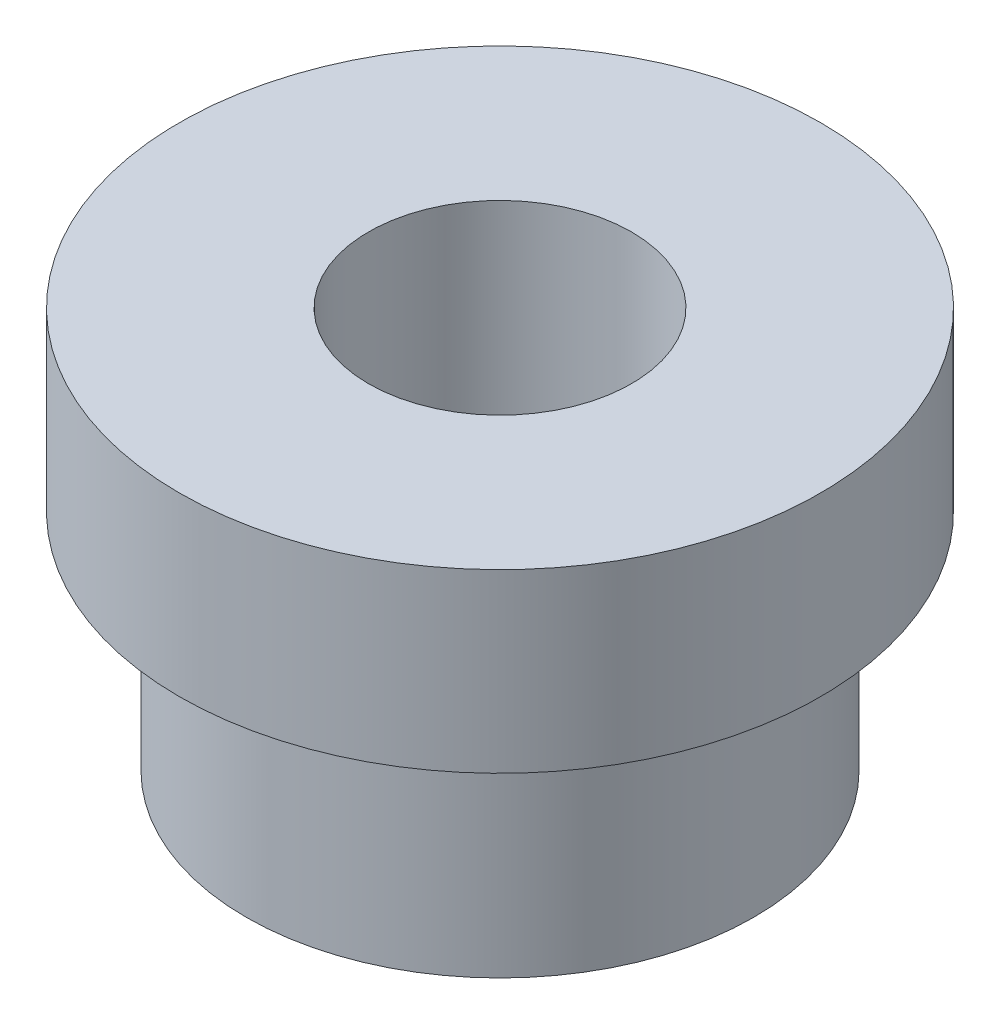
ISO-10303-21;
HEADER;
FILE_DESCRIPTION(('STEP AP214'),'2;1');
FILE_NAME('part.step','',(''),(''),'','','');
FILE_SCHEMA(('AUTOMOTIVE_DESIGN { 1 0 10303 214 1 1 1 1 }'));
ENDSEC;
DATA;
#1=APPLICATION_CONTEXT('core data for automotive mechanical design processes');
#2=APPLICATION_PROTOCOL_DEFINITION('international standard','automotive_design',2000,#1);
#3=PRODUCT_CONTEXT('',#1,'mechanical');
#4=PRODUCT('Part','Part','',(#3));
#5=PRODUCT_RELATED_PRODUCT_CATEGORY('part','',(#4));
#6=PRODUCT_DEFINITION_FORMATION('','',#4);
#7=PRODUCT_DEFINITION_CONTEXT('part definition',#1,'design');
#8=PRODUCT_DEFINITION('design','',#6,#7);
#9=PRODUCT_DEFINITION_SHAPE('','',#8);
#10=(LENGTH_UNIT() NAMED_UNIT(*) SI_UNIT(.MILLI.,.METRE.));
#11=(NAMED_UNIT(*) PLANE_ANGLE_UNIT() SI_UNIT($,.RADIAN.));
#12=(NAMED_UNIT(*) SI_UNIT($,.STERADIAN.) SOLID_ANGLE_UNIT());
#13=UNCERTAINTY_MEASURE_WITH_UNIT(LENGTH_MEASURE(1.E-05),#10,'distance_accuracy_value','');
#14=(GEOMETRIC_REPRESENTATION_CONTEXT(3) GLOBAL_UNCERTAINTY_ASSIGNED_CONTEXT((#13)) GLOBAL_UNIT_ASSIGNED_CONTEXT((#10,
#11,#12)) REPRESENTATION_CONTEXT('',''));
#15=CARTESIAN_POINT('',(0.,0.,0.));
#16=DIRECTION('',(0.,0.,1.));
#17=DIRECTION('',(1.,0.,0.));
#18=AXIS2_PLACEMENT_3D('',#15,#16,#17);
#19=CARTESIAN_POINT('',(0.,19.05,0.));
#20=DIRECTION('',(0.,-1.,0.));
#21=DIRECTION('',(0.,0.,-1.));
#22=AXIS2_PLACEMENT_3D('',#19,#20,#21);
#23=PLANE('',#22);
#24=CARTESIAN_POINT('',(0.,19.05,0.));
#25=DIRECTION('',(0.,1.,0.));
#26=DIRECTION('',(0.,0.,1.));
#27=AXIS2_PLACEMENT_3D('',#24,#25,#26);
#28=CIRCLE('',#27,6.24999999999999);
#29=CARTESIAN_POINT('',(0.,19.05,6.24999999999999));
#30=VERTEX_POINT('',#29);
#31=EDGE_CURVE('E59',#30,#30,#28,.T.);
#32=ORIENTED_EDGE('',*,*,#31,.F.);
#33=EDGE_LOOP('',(#32));
#34=FACE_BOUND('',#33,.T.);
#35=CARTESIAN_POINT('',(0.,19.05,0.));
#36=DIRECTION('',(0.,-1.,0.));
#37=DIRECTION('',(0.,0.,-1.));
#38=AXIS2_PLACEMENT_3D('',#35,#36,#37);
#39=CIRCLE('',#38,15.24);
#40=CARTESIAN_POINT('',(0.,19.05,-15.24));
#41=VERTEX_POINT('',#40);
#42=EDGE_CURVE('E51',#41,#41,#39,.T.);
#43=ORIENTED_EDGE('',*,*,#42,.F.);
#44=EDGE_LOOP('',(#43));
#45=FACE_BOUND('',#44,.T.);
#46=ADVANCED_FACE('F37',(#34,#45),#23,.F.);
#47=CARTESIAN_POINT('',(0.,0.,0.));
#48=DIRECTION('',(0.,-1.,0.));
#49=DIRECTION('',(0.,0.,-1.));
#50=AXIS2_PLACEMENT_3D('',#47,#48,#49);
#51=PLANE('',#50);
#52=CARTESIAN_POINT('',(0.,0.,0.));
#53=DIRECTION('',(0.,1.,0.));
#54=DIRECTION('',(0.,0.,1.));
#55=AXIS2_PLACEMENT_3D('',#52,#53,#54);
#56=CIRCLE('',#55,6.25);
#57=CARTESIAN_POINT('',(0.,0.,6.25));
#58=VERTEX_POINT('',#57);
#59=EDGE_CURVE('E56',#58,#58,#56,.T.);
#60=ORIENTED_EDGE('',*,*,#59,.T.);
#61=EDGE_LOOP('',(#60));
#62=FACE_BOUND('',#61,.T.);
#63=CARTESIAN_POINT('',(0.,0.,0.));
#64=DIRECTION('',(0.,-1.,0.));
#65=DIRECTION('',(0.,0.,-1.));
#66=AXIS2_PLACEMENT_3D('',#63,#64,#65);
#67=CIRCLE('',#66,12.065);
#68=CARTESIAN_POINT('',(0.,0.,-12.065));
#69=VERTEX_POINT('',#68);
#70=EDGE_CURVE('E10',#69,#69,#67,.T.);
#71=ORIENTED_EDGE('',*,*,#70,.T.);
#72=EDGE_LOOP('',(#71));
#73=FACE_BOUND('',#72,.T.);
#74=ADVANCED_FACE('F67',(#62,#73),#51,.T.);
#75=CARTESIAN_POINT('',(0.,17.78,0.));
#76=DIRECTION('',(0.,-1.,0.));
#77=DIRECTION('',(0.,0.,-1.));
#78=AXIS2_PLACEMENT_3D('',#75,#76,#77);
#79=CYLINDRICAL_SURFACE('',#78,12.065);
#80=CARTESIAN_POINT('',(0.,10.668,0.));
#81=DIRECTION('',(0.,-1.,0.));
#82=DIRECTION('',(0.,0.,-1.));
#83=AXIS2_PLACEMENT_3D('',#80,#81,#82);
#84=CIRCLE('',#83,12.065);
#85=CARTESIAN_POINT('',(0.,10.668,-12.065));
#86=VERTEX_POINT('',#85);
#87=EDGE_CURVE('E43',#86,#86,#84,.T.);
#88=ORIENTED_EDGE('',*,*,#87,.T.);
#89=EDGE_LOOP('',(#88));
#90=FACE_BOUND('',#89,.T.);
#91=ORIENTED_EDGE('',*,*,#70,.F.);
#92=EDGE_LOOP('',(#91));
#93=FACE_BOUND('',#92,.T.);
#94=ADVANCED_FACE('F79',(#90,#93),#79,.T.);
#95=CARTESIAN_POINT('',(0.,10.668,0.));
#96=DIRECTION('',(0.,-1.,0.));
#97=DIRECTION('',(0.,0.,-1.));
#98=AXIS2_PLACEMENT_3D('',#95,#96,#97);
#99=PLANE('',#98);
#100=CARTESIAN_POINT('',(0.,10.668,0.));
#101=DIRECTION('',(0.,-1.,0.));
#102=DIRECTION('',(0.,0.,-1.));
#103=AXIS2_PLACEMENT_3D('',#100,#101,#102);
#104=CIRCLE('',#103,15.24);
#105=CARTESIAN_POINT('',(0.,10.668,-15.24));
#106=VERTEX_POINT('',#105);
#107=EDGE_CURVE('E47',#106,#106,#104,.T.);
#108=ORIENTED_EDGE('',*,*,#107,.T.);
#109=EDGE_LOOP('',(#108));
#110=FACE_BOUND('',#109,.T.);
#111=ORIENTED_EDGE('',*,*,#87,.F.);
#112=EDGE_LOOP('',(#111));
#113=FACE_BOUND('',#112,.T.);
#114=ADVANCED_FACE('F73',(#110,#113),#99,.T.);
#115=CARTESIAN_POINT('',(0.,17.78,0.));
#116=DIRECTION('',(0.,-1.,0.));
#117=DIRECTION('',(0.,0.,-1.));
#118=AXIS2_PLACEMENT_3D('',#115,#116,#117);
#119=CYLINDRICAL_SURFACE('',#118,15.24);
#120=ORIENTED_EDGE('',*,*,#42,.T.);
#121=EDGE_LOOP('',(#120));
#122=FACE_BOUND('',#121,.T.);
#123=ORIENTED_EDGE('',*,*,#107,.F.);
#124=EDGE_LOOP('',(#123));
#125=FACE_BOUND('',#124,.T.);
#126=ADVANCED_FACE('F70',(#122,#125),#119,.T.);
#127=CARTESIAN_POINT('',(0.,19.05,0.));
#128=DIRECTION('',(0.,1.,0.));
#129=DIRECTION('',(0.,0.,1.));
#130=AXIS2_PLACEMENT_3D('',#127,#128,#129);
#131=CYLINDRICAL_SURFACE('',#130,6.24999999999999);
#132=ORIENTED_EDGE('',*,*,#59,.F.);
#133=EDGE_LOOP('',(#132));
#134=FACE_BOUND('',#133,.T.);
#135=ORIENTED_EDGE('',*,*,#31,.T.);
#136=EDGE_LOOP('',(#135));
#137=FACE_BOUND('',#136,.T.);
#138=ADVANCED_FACE('F63',(#134,#137),#131,.F.);
#139=CLOSED_SHELL('',(#46,#74,#94,#114,#126,#138));
#140=MANIFOLD_SOLID_BREP('B2',#139);
#141=ADVANCED_BREP_SHAPE_REPRESENTATION('',(#18,#140),#14);
#142=SHAPE_DEFINITION_REPRESENTATION(#9,#141);
ENDSEC;
END-ISO-10303-21;
